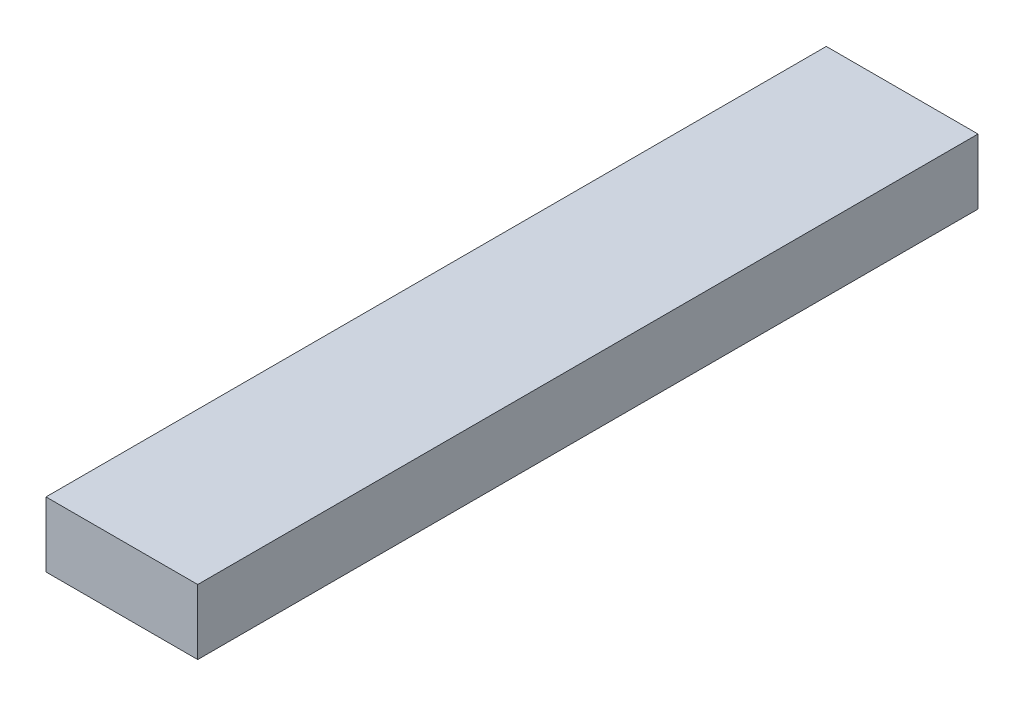
ISO-10303-21;
HEADER;
FILE_DESCRIPTION(('STEP AP214'),'2;1');
FILE_NAME('part.step','',(''),(''),'','','');
FILE_SCHEMA(('AUTOMOTIVE_DESIGN { 1 0 10303 214 1 1 1 1 }'));
ENDSEC;
DATA;
#1=APPLICATION_CONTEXT('core data for automotive mechanical design processes');
#2=APPLICATION_PROTOCOL_DEFINITION('international standard','automotive_design',2000,#1);
#3=PRODUCT_CONTEXT('',#1,'mechanical');
#4=PRODUCT('Part','Part','',(#3));
#5=PRODUCT_RELATED_PRODUCT_CATEGORY('part','',(#4));
#6=PRODUCT_DEFINITION_FORMATION('','',#4);
#7=PRODUCT_DEFINITION_CONTEXT('part definition',#1,'design');
#8=PRODUCT_DEFINITION('design','',#6,#7);
#9=PRODUCT_DEFINITION_SHAPE('','',#8);
#10=(LENGTH_UNIT() NAMED_UNIT(*) SI_UNIT(.MILLI.,.METRE.));
#11=(NAMED_UNIT(*) PLANE_ANGLE_UNIT() SI_UNIT($,.RADIAN.));
#12=(NAMED_UNIT(*) SI_UNIT($,.STERADIAN.) SOLID_ANGLE_UNIT());
#13=UNCERTAINTY_MEASURE_WITH_UNIT(LENGTH_MEASURE(1.E-05),#10,'distance_accuracy_value','');
#14=(GEOMETRIC_REPRESENTATION_CONTEXT(3) GLOBAL_UNCERTAINTY_ASSIGNED_CONTEXT((#13)) GLOBAL_UNIT_ASSIGNED_CONTEXT((#10,
#11,#12)) REPRESENTATION_CONTEXT('',''));
#15=CARTESIAN_POINT('',(0.,0.,0.));
#16=DIRECTION('',(0.,0.,1.));
#17=DIRECTION('',(1.,0.,0.));
#18=AXIS2_PLACEMENT_3D('',#15,#16,#17);
#19=CARTESIAN_POINT('',(-7.95120108339334,26.3769230769231,457.2));
#20=DIRECTION('',(1.,0.,0.));
#21=DIRECTION('',(0.,0.,-1.));
#22=AXIS2_PLACEMENT_3D('',#19,#20,#21);
#23=PLANE('',#22);
#24=DIRECTION('',(0.,-1.,0.));
#25=VECTOR('',#24,1.);
#26=CARTESIAN_POINT('',(-7.95120108339334,26.3769230769231,0.));
#27=LINE('',#26,#25);
#28=CARTESIAN_POINT('',(-7.95120108339334,26.3769230769231,0.));
#29=VERTEX_POINT('',#28);
#30=CARTESIAN_POINT('',(-7.95120108339334,-11.7230769230769,0.));
#31=VERTEX_POINT('',#30);
#32=EDGE_CURVE('E107',#29,#31,#27,.T.);
#33=ORIENTED_EDGE('',*,*,#32,.T.);
#34=DIRECTION('',(0.,0.,-1.));
#35=VECTOR('',#34,1.);
#36=CARTESIAN_POINT('',(-7.95120108339334,-11.7230769230769,457.2));
#37=LINE('',#36,#35);
#38=CARTESIAN_POINT('',(-7.95120108339334,-11.7230769230769,457.2));
#39=VERTEX_POINT('',#38);
#40=EDGE_CURVE('E11',#39,#31,#37,.T.);
#41=ORIENTED_EDGE('',*,*,#40,.F.);
#42=DIRECTION('',(0.,-1.,0.));
#43=VECTOR('',#42,1.);
#44=CARTESIAN_POINT('',(-7.95120108339334,26.3769230769231,457.2));
#45=LINE('',#44,#43);
#46=CARTESIAN_POINT('',(-7.95120108339334,26.3769230769231,457.2));
#47=VERTEX_POINT('',#46);
#48=EDGE_CURVE('E91',#47,#39,#45,.T.);
#49=ORIENTED_EDGE('',*,*,#48,.F.);
#50=DIRECTION('',(0.,0.,-1.));
#51=VECTOR('',#50,1.);
#52=CARTESIAN_POINT('',(-7.95120108339334,26.3769230769231,457.2));
#53=LINE('',#52,#51);
#54=EDGE_CURVE('E103',#47,#29,#53,.T.);
#55=ORIENTED_EDGE('',*,*,#54,.T.);
#56=EDGE_LOOP('',(#33,#41,#49,#55));
#57=FACE_BOUND('',#56,.T.);
#58=ADVANCED_FACE('F39',(#57),#23,.F.);
#59=CARTESIAN_POINT('',(-7.95120108339334,-11.7230769230769,457.2));
#60=DIRECTION('',(0.,1.,0.));
#61=DIRECTION('',(-1.,0.,0.));
#62=AXIS2_PLACEMENT_3D('',#59,#60,#61);
#63=PLANE('',#62);
#64=DIRECTION('',(1.,0.,0.));
#65=VECTOR('',#64,1.);
#66=CARTESIAN_POINT('',(-7.95120108339334,-11.7230769230769,0.));
#67=LINE('',#66,#65);
#68=CARTESIAN_POINT('',(80.9487989166066,-11.7230769230769,0.));
#69=VERTEX_POINT('',#68);
#70=EDGE_CURVE('E96',#31,#69,#67,.T.);
#71=ORIENTED_EDGE('',*,*,#70,.T.);
#72=DIRECTION('',(0.,0.,-1.));
#73=VECTOR('',#72,1.);
#74=CARTESIAN_POINT('',(80.9487989166066,-11.7230769230769,457.2));
#75=LINE('',#74,#73);
#76=CARTESIAN_POINT('',(80.9487989166066,-11.7230769230769,457.2));
#77=VERTEX_POINT('',#76);
#78=EDGE_CURVE('E48',#77,#69,#75,.T.);
#79=ORIENTED_EDGE('',*,*,#78,.F.);
#80=DIRECTION('',(1.,0.,0.));
#81=VECTOR('',#80,1.);
#82=CARTESIAN_POINT('',(-7.95120108339334,-11.7230769230769,457.2));
#83=LINE('',#82,#81);
#84=EDGE_CURVE('E86',#39,#77,#83,.T.);
#85=ORIENTED_EDGE('',*,*,#84,.F.);
#86=ORIENTED_EDGE('',*,*,#40,.T.);
#87=EDGE_LOOP('',(#71,#79,#85,#86));
#88=FACE_BOUND('',#87,.T.);
#89=ADVANCED_FACE('F95',(#88),#63,.F.);
#90=CARTESIAN_POINT('',(80.9487989166066,26.3769230769231,457.2));
#91=DIRECTION('',(-1.,0.,0.));
#92=DIRECTION('',(0.,0.,1.));
#93=AXIS2_PLACEMENT_3D('',#90,#91,#92);
#94=PLANE('',#93);
#95=DIRECTION('',(0.,1.,0.));
#96=VECTOR('',#95,1.);
#97=CARTESIAN_POINT('',(80.9487989166066,26.3769230769231,0.));
#98=LINE('',#97,#96);
#99=CARTESIAN_POINT('',(80.9487989166066,26.3769230769231,0.));
#100=VERTEX_POINT('',#99);
#101=EDGE_CURVE('E73',#69,#100,#98,.T.);
#102=ORIENTED_EDGE('',*,*,#101,.T.);
#103=DIRECTION('',(0.,0.,-1.));
#104=VECTOR('',#103,1.);
#105=CARTESIAN_POINT('',(80.9487989166066,26.3769230769231,457.2));
#106=LINE('',#105,#104);
#107=CARTESIAN_POINT('',(80.9487989166066,26.3769230769231,457.2));
#108=VERTEX_POINT('',#107);
#109=EDGE_CURVE('E98',#108,#100,#106,.T.);
#110=ORIENTED_EDGE('',*,*,#109,.F.);
#111=DIRECTION('',(0.,1.,0.));
#112=VECTOR('',#111,1.);
#113=CARTESIAN_POINT('',(80.9487989166066,26.3769230769231,457.2));
#114=LINE('',#113,#112);
#115=EDGE_CURVE('E89',#77,#108,#114,.T.);
#116=ORIENTED_EDGE('',*,*,#115,.F.);
#117=ORIENTED_EDGE('',*,*,#78,.T.);
#118=EDGE_LOOP('',(#102,#110,#116,#117));
#119=FACE_BOUND('',#118,.T.);
#120=ADVANCED_FACE('F99',(#119),#94,.F.);
#121=CARTESIAN_POINT('',(-7.95120108339334,26.3769230769231,457.2));
#122=DIRECTION('',(0.,-1.,0.));
#123=DIRECTION('',(0.,0.,-1.));
#124=AXIS2_PLACEMENT_3D('',#121,#122,#123);
#125=PLANE('',#124);
#126=DIRECTION('',(-1.,0.,0.));
#127=VECTOR('',#126,1.);
#128=CARTESIAN_POINT('',(-7.95120108339334,26.3769230769231,0.));
#129=LINE('',#128,#127);
#130=EDGE_CURVE('E79',#100,#29,#129,.T.);
#131=ORIENTED_EDGE('',*,*,#130,.T.);
#132=ORIENTED_EDGE('',*,*,#54,.F.);
#133=DIRECTION('',(-1.,0.,0.));
#134=VECTOR('',#133,1.);
#135=CARTESIAN_POINT('',(-7.95120108339334,26.3769230769231,457.2));
#136=LINE('',#135,#134);
#137=EDGE_CURVE('E56',#108,#47,#136,.T.);
#138=ORIENTED_EDGE('',*,*,#137,.F.);
#139=ORIENTED_EDGE('',*,*,#109,.T.);
#140=EDGE_LOOP('',(#131,#132,#138,#139));
#141=FACE_BOUND('',#140,.T.);
#142=ADVANCED_FACE('F120',(#141),#125,.F.);
#143=CARTESIAN_POINT('',(0.,0.,457.2));
#144=DIRECTION('',(0.,0.,1.));
#145=DIRECTION('',(1.,0.,0.));
#146=AXIS2_PLACEMENT_3D('',#143,#144,#145);
#147=PLANE('',#146);
#148=ORIENTED_EDGE('',*,*,#48,.T.);
#149=ORIENTED_EDGE('',*,*,#84,.T.);
#150=ORIENTED_EDGE('',*,*,#115,.T.);
#151=ORIENTED_EDGE('',*,*,#137,.T.);
#152=EDGE_LOOP('',(#148,#149,#150,#151));
#153=FACE_BOUND('',#152,.T.);
#154=ADVANCED_FACE('F87',(#153),#147,.T.);
#155=CARTESIAN_POINT('',(0.,0.,0.));
#156=DIRECTION('',(0.,0.,1.));
#157=DIRECTION('',(1.,0.,0.));
#158=AXIS2_PLACEMENT_3D('',#155,#156,#157);
#159=PLANE('',#158);
#160=ORIENTED_EDGE('',*,*,#32,.F.);
#161=ORIENTED_EDGE('',*,*,#130,.F.);
#162=ORIENTED_EDGE('',*,*,#101,.F.);
#163=ORIENTED_EDGE('',*,*,#70,.F.);
#164=EDGE_LOOP('',(#160,#161,#162,#163));
#165=FACE_BOUND('',#164,.T.);
#166=ADVANCED_FACE('F123',(#165),#159,.F.);
#167=CLOSED_SHELL('',(#58,#89,#120,#142,#154,#166));
#168=MANIFOLD_SOLID_BREP('B2',#167);
#169=ADVANCED_BREP_SHAPE_REPRESENTATION('',(#18,#168),#14);
#170=SHAPE_DEFINITION_REPRESENTATION(#9,#169);
ENDSEC;
END-ISO-10303-21;
